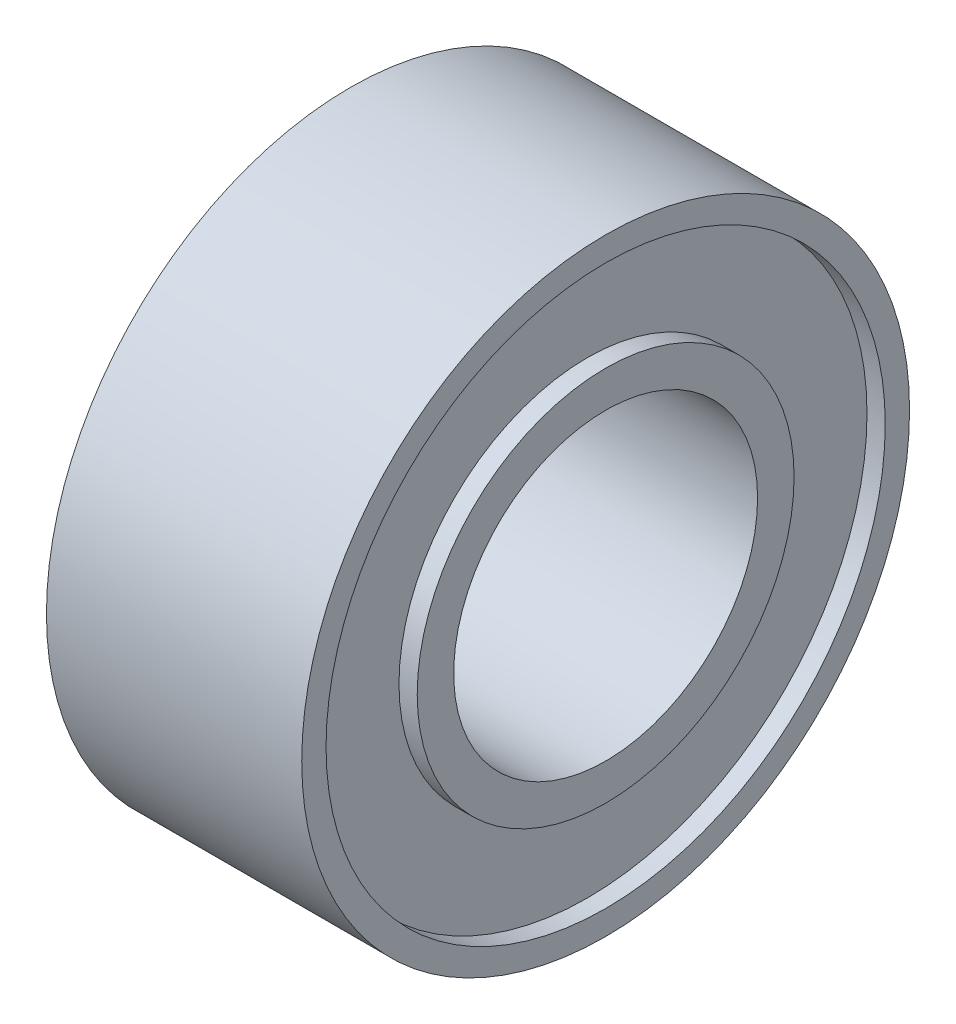
ISO-10303-21;
HEADER;
FILE_DESCRIPTION(('STEP AP214'),'2;1');
FILE_NAME('part.step','',(''),(''),'','','');
FILE_SCHEMA(('AUTOMOTIVE_DESIGN { 1 0 10303 214 1 1 1 1 }'));
ENDSEC;
DATA;
#1=APPLICATION_CONTEXT('core data for automotive mechanical design processes');
#2=APPLICATION_PROTOCOL_DEFINITION('international standard','automotive_design',2000,#1);
#3=PRODUCT_CONTEXT('',#1,'mechanical');
#4=PRODUCT('Part','Part','',(#3));
#5=PRODUCT_RELATED_PRODUCT_CATEGORY('part','',(#4));
#6=PRODUCT_DEFINITION_FORMATION('','',#4);
#7=PRODUCT_DEFINITION_CONTEXT('part definition',#1,'design');
#8=PRODUCT_DEFINITION('design','',#6,#7);
#9=PRODUCT_DEFINITION_SHAPE('','',#8);
#10=(LENGTH_UNIT() NAMED_UNIT(*) SI_UNIT(.MILLI.,.METRE.));
#11=(NAMED_UNIT(*) PLANE_ANGLE_UNIT() SI_UNIT($,.RADIAN.));
#12=(NAMED_UNIT(*) SI_UNIT($,.STERADIAN.) SOLID_ANGLE_UNIT());
#13=UNCERTAINTY_MEASURE_WITH_UNIT(LENGTH_MEASURE(1.E-05),#10,'distance_accuracy_value','');
#14=(GEOMETRIC_REPRESENTATION_CONTEXT(3) GLOBAL_UNCERTAINTY_ASSIGNED_CONTEXT((#13)) GLOBAL_UNIT_ASSIGNED_CONTEXT((#10,
#11,#12)) REPRESENTATION_CONTEXT('',''));
#15=CARTESIAN_POINT('',(0.,0.,0.));
#16=DIRECTION('',(0.,0.,1.));
#17=DIRECTION('',(1.,0.,0.));
#18=AXIS2_PLACEMENT_3D('',#15,#16,#17);
#19=CARTESIAN_POINT('',(-2.1,2.5,0.));
#20=DIRECTION('',(-1.,0.,0.));
#21=DIRECTION('',(0.,0.,1.));
#22=AXIS2_PLACEMENT_3D('',#19,#20,#21);
#23=PLANE('',#22);
#24=CARTESIAN_POINT('',(-2.1,0.,0.));
#25=DIRECTION('',(1.,0.,0.));
#26=DIRECTION('',(0.,0.,-1.));
#27=AXIS2_PLACEMENT_3D('',#24,#25,#26);
#28=CIRCLE('',#27,2.5);
#29=CARTESIAN_POINT('',(-2.1,0.,-2.5));
#30=VERTEX_POINT('',#29);
#31=EDGE_CURVE('E81',#30,#30,#28,.T.);
#32=ORIENTED_EDGE('',*,*,#31,.T.);
#33=EDGE_LOOP('',(#32));
#34=FACE_BOUND('',#33,.T.);
#35=CARTESIAN_POINT('',(-2.1,0.,0.));
#36=DIRECTION('',(1.,0.,0.));
#37=DIRECTION('',(0.,0.,-1.));
#38=AXIS2_PLACEMENT_3D('',#35,#36,#37);
#39=CIRCLE('',#38,3.1);
#40=CARTESIAN_POINT('',(-2.1,0.,-3.1));
#41=VERTEX_POINT('',#40);
#42=EDGE_CURVE('E10',#41,#41,#39,.T.);
#43=ORIENTED_EDGE('',*,*,#42,.F.);
#44=EDGE_LOOP('',(#43));
#45=FACE_BOUND('',#44,.T.);
#46=ADVANCED_FACE('F41',(#34,#45),#23,.T.);
#47=CARTESIAN_POINT('',(0.,0.,0.));
#48=DIRECTION('',(1.,0.,0.));
#49=DIRECTION('',(0.,0.,-1.));
#50=AXIS2_PLACEMENT_3D('',#47,#48,#49);
#51=CYLINDRICAL_SURFACE('',#50,3.1);
#52=ORIENTED_EDGE('',*,*,#42,.T.);
#53=EDGE_LOOP('',(#52));
#54=FACE_BOUND('',#53,.T.);
#55=CARTESIAN_POINT('',(-1.8,0.,0.));
#56=DIRECTION('',(1.,0.,0.));
#57=DIRECTION('',(0.,0.,-1.));
#58=AXIS2_PLACEMENT_3D('',#55,#56,#57);
#59=CIRCLE('',#58,3.1);
#60=CARTESIAN_POINT('',(-1.8,0.,-3.1));
#61=VERTEX_POINT('',#60);
#62=EDGE_CURVE('E47',#61,#61,#59,.T.);
#63=ORIENTED_EDGE('',*,*,#62,.F.);
#64=EDGE_LOOP('',(#63));
#65=FACE_BOUND('',#64,.T.);
#66=ADVANCED_FACE('F99',(#54,#65),#51,.T.);
#67=CARTESIAN_POINT('',(-1.8,3.1,0.));
#68=DIRECTION('',(-1.,0.,0.));
#69=DIRECTION('',(0.,0.,1.));
#70=AXIS2_PLACEMENT_3D('',#67,#68,#69);
#71=PLANE('',#70);
#72=ORIENTED_EDGE('',*,*,#62,.T.);
#73=EDGE_LOOP('',(#72));
#74=FACE_BOUND('',#73,.T.);
#75=CARTESIAN_POINT('',(-1.8,0.,0.));
#76=DIRECTION('',(1.,0.,0.));
#77=DIRECTION('',(0.,0.,-1.));
#78=AXIS2_PLACEMENT_3D('',#75,#76,#77);
#79=CIRCLE('',#78,4.6);
#80=CARTESIAN_POINT('',(-1.8,0.,-4.6));
#81=VERTEX_POINT('',#80);
#82=EDGE_CURVE('E51',#81,#81,#79,.T.);
#83=ORIENTED_EDGE('',*,*,#82,.F.);
#84=EDGE_LOOP('',(#83));
#85=FACE_BOUND('',#84,.T.);
#86=ADVANCED_FACE('F103',(#74,#85),#71,.T.);
#87=CARTESIAN_POINT('',(0.,0.,0.));
#88=DIRECTION('',(1.,0.,0.));
#89=DIRECTION('',(0.,0.,-1.));
#90=AXIS2_PLACEMENT_3D('',#87,#88,#89);
#91=CYLINDRICAL_SURFACE('',#90,4.6);
#92=ORIENTED_EDGE('',*,*,#82,.T.);
#93=EDGE_LOOP('',(#92));
#94=FACE_BOUND('',#93,.T.);
#95=CARTESIAN_POINT('',(-2.1,0.,0.));
#96=DIRECTION('',(1.,0.,0.));
#97=DIRECTION('',(0.,0.,-1.));
#98=AXIS2_PLACEMENT_3D('',#95,#96,#97);
#99=CIRCLE('',#98,4.6);
#100=CARTESIAN_POINT('',(-2.1,0.,-4.6));
#101=VERTEX_POINT('',#100);
#102=EDGE_CURVE('E55',#101,#101,#99,.T.);
#103=ORIENTED_EDGE('',*,*,#102,.F.);
#104=EDGE_LOOP('',(#103));
#105=FACE_BOUND('',#104,.T.);
#106=ADVANCED_FACE('F108',(#94,#105),#91,.F.);
#107=CARTESIAN_POINT('',(-2.1,4.6,0.));
#108=DIRECTION('',(-1.,0.,0.));
#109=DIRECTION('',(0.,0.,1.));
#110=AXIS2_PLACEMENT_3D('',#107,#108,#109);
#111=PLANE('',#110);
#112=ORIENTED_EDGE('',*,*,#102,.T.);
#113=EDGE_LOOP('',(#112));
#114=FACE_BOUND('',#113,.T.);
#115=CARTESIAN_POINT('',(-2.1,0.,0.));
#116=DIRECTION('',(1.,0.,0.));
#117=DIRECTION('',(0.,0.,-1.));
#118=AXIS2_PLACEMENT_3D('',#115,#116,#117);
#119=CIRCLE('',#118,5.);
#120=CARTESIAN_POINT('',(-2.1,0.,-5.));
#121=VERTEX_POINT('',#120);
#122=EDGE_CURVE('E60',#121,#121,#119,.T.);
#123=ORIENTED_EDGE('',*,*,#122,.F.);
#124=EDGE_LOOP('',(#123));
#125=FACE_BOUND('',#124,.T.);
#126=ADVANCED_FACE('F114',(#114,#125),#111,.T.);
#127=CARTESIAN_POINT('',(0.,0.,0.));
#128=DIRECTION('',(1.,0.,0.));
#129=DIRECTION('',(0.,0.,-1.));
#130=AXIS2_PLACEMENT_3D('',#127,#128,#129);
#131=CYLINDRICAL_SURFACE('',#130,5.);
#132=ORIENTED_EDGE('',*,*,#122,.T.);
#133=EDGE_LOOP('',(#132));
#134=FACE_BOUND('',#133,.T.);
#135=CARTESIAN_POINT('',(2.1,0.,0.));
#136=DIRECTION('',(1.,0.,0.));
#137=DIRECTION('',(0.,0.,-1.));
#138=AXIS2_PLACEMENT_3D('',#135,#136,#137);
#139=CIRCLE('',#138,5.);
#140=CARTESIAN_POINT('',(2.1,0.,-5.));
#141=VERTEX_POINT('',#140);
#142=EDGE_CURVE('E63',#141,#141,#139,.T.);
#143=ORIENTED_EDGE('',*,*,#142,.F.);
#144=EDGE_LOOP('',(#143));
#145=FACE_BOUND('',#144,.T.);
#146=ADVANCED_FACE('F118',(#134,#145),#131,.T.);
#147=CARTESIAN_POINT('',(2.1,4.6,0.));
#148=DIRECTION('',(1.,0.,0.));
#149=DIRECTION('',(0.,0.,-1.));
#150=AXIS2_PLACEMENT_3D('',#147,#148,#149);
#151=PLANE('',#150);
#152=ORIENTED_EDGE('',*,*,#142,.T.);
#153=EDGE_LOOP('',(#152));
#154=FACE_BOUND('',#153,.T.);
#155=CARTESIAN_POINT('',(2.1,0.,0.));
#156=DIRECTION('',(1.,0.,0.));
#157=DIRECTION('',(0.,0.,-1.));
#158=AXIS2_PLACEMENT_3D('',#155,#156,#157);
#159=CIRCLE('',#158,4.6);
#160=CARTESIAN_POINT('',(2.1,0.,-4.6));
#161=VERTEX_POINT('',#160);
#162=EDGE_CURVE('E66',#161,#161,#159,.T.);
#163=ORIENTED_EDGE('',*,*,#162,.F.);
#164=EDGE_LOOP('',(#163));
#165=FACE_BOUND('',#164,.T.);
#166=ADVANCED_FACE('F122',(#154,#165),#151,.T.);
#167=CARTESIAN_POINT('',(0.,0.,0.));
#168=DIRECTION('',(1.,0.,0.));
#169=DIRECTION('',(0.,0.,-1.));
#170=AXIS2_PLACEMENT_3D('',#167,#168,#169);
#171=CYLINDRICAL_SURFACE('',#170,4.6);
#172=ORIENTED_EDGE('',*,*,#162,.T.);
#173=EDGE_LOOP('',(#172));
#174=FACE_BOUND('',#173,.T.);
#175=CARTESIAN_POINT('',(1.8,0.,0.));
#176=DIRECTION('',(1.,0.,0.));
#177=DIRECTION('',(0.,0.,-1.));
#178=AXIS2_PLACEMENT_3D('',#175,#176,#177);
#179=CIRCLE('',#178,4.6);
#180=CARTESIAN_POINT('',(1.8,0.,-4.6));
#181=VERTEX_POINT('',#180);
#182=EDGE_CURVE('E69',#181,#181,#179,.T.);
#183=ORIENTED_EDGE('',*,*,#182,.F.);
#184=EDGE_LOOP('',(#183));
#185=FACE_BOUND('',#184,.T.);
#186=ADVANCED_FACE('F126',(#174,#185),#171,.F.);
#187=CARTESIAN_POINT('',(1.8,3.1,0.));
#188=DIRECTION('',(1.,0.,0.));
#189=DIRECTION('',(0.,0.,-1.));
#190=AXIS2_PLACEMENT_3D('',#187,#188,#189);
#191=PLANE('',#190);
#192=ORIENTED_EDGE('',*,*,#182,.T.);
#193=EDGE_LOOP('',(#192));
#194=FACE_BOUND('',#193,.T.);
#195=CARTESIAN_POINT('',(1.8,0.,0.));
#196=DIRECTION('',(1.,0.,0.));
#197=DIRECTION('',(0.,0.,-1.));
#198=AXIS2_PLACEMENT_3D('',#195,#196,#197);
#199=CIRCLE('',#198,3.1);
#200=CARTESIAN_POINT('',(1.8,0.,-3.1));
#201=VERTEX_POINT('',#200);
#202=EDGE_CURVE('E72',#201,#201,#199,.T.);
#203=ORIENTED_EDGE('',*,*,#202,.F.);
#204=EDGE_LOOP('',(#203));
#205=FACE_BOUND('',#204,.T.);
#206=ADVANCED_FACE('F130',(#194,#205),#191,.T.);
#207=CARTESIAN_POINT('',(0.,0.,0.));
#208=DIRECTION('',(1.,0.,0.));
#209=DIRECTION('',(0.,0.,-1.));
#210=AXIS2_PLACEMENT_3D('',#207,#208,#209);
#211=CYLINDRICAL_SURFACE('',#210,3.1);
#212=ORIENTED_EDGE('',*,*,#202,.T.);
#213=EDGE_LOOP('',(#212));
#214=FACE_BOUND('',#213,.T.);
#215=CARTESIAN_POINT('',(2.1,0.,0.));
#216=DIRECTION('',(1.,0.,0.));
#217=DIRECTION('',(0.,0.,-1.));
#218=AXIS2_PLACEMENT_3D('',#215,#216,#217);
#219=CIRCLE('',#218,3.1);
#220=CARTESIAN_POINT('',(2.1,0.,-3.1));
#221=VERTEX_POINT('',#220);
#222=EDGE_CURVE('E75',#221,#221,#219,.T.);
#223=ORIENTED_EDGE('',*,*,#222,.F.);
#224=EDGE_LOOP('',(#223));
#225=FACE_BOUND('',#224,.T.);
#226=ADVANCED_FACE('F95',(#214,#225),#211,.T.);
#227=CARTESIAN_POINT('',(2.1,2.5,0.));
#228=DIRECTION('',(1.,0.,0.));
#229=DIRECTION('',(0.,0.,-1.));
#230=AXIS2_PLACEMENT_3D('',#227,#228,#229);
#231=PLANE('',#230);
#232=ORIENTED_EDGE('',*,*,#222,.T.);
#233=EDGE_LOOP('',(#232));
#234=FACE_BOUND('',#233,.T.);
#235=CARTESIAN_POINT('',(2.1,0.,0.));
#236=DIRECTION('',(1.,0.,0.));
#237=DIRECTION('',(0.,0.,-1.));
#238=AXIS2_PLACEMENT_3D('',#235,#236,#237);
#239=CIRCLE('',#238,2.5);
#240=CARTESIAN_POINT('',(2.1,0.,-2.5));
#241=VERTEX_POINT('',#240);
#242=EDGE_CURVE('E78',#241,#241,#239,.T.);
#243=ORIENTED_EDGE('',*,*,#242,.F.);
#244=EDGE_LOOP('',(#243));
#245=FACE_BOUND('',#244,.T.);
#246=ADVANCED_FACE('F89',(#234,#245),#231,.T.);
#247=CARTESIAN_POINT('',(0.,0.,0.));
#248=DIRECTION('',(1.,0.,0.));
#249=DIRECTION('',(0.,0.,-1.));
#250=AXIS2_PLACEMENT_3D('',#247,#248,#249);
#251=CYLINDRICAL_SURFACE('',#250,2.5);
#252=ORIENTED_EDGE('',*,*,#242,.T.);
#253=EDGE_LOOP('',(#252));
#254=FACE_BOUND('',#253,.T.);
#255=ORIENTED_EDGE('',*,*,#31,.F.);
#256=EDGE_LOOP('',(#255));
#257=FACE_BOUND('',#256,.T.);
#258=ADVANCED_FACE('F87',(#254,#257),#251,.F.);
#259=CLOSED_SHELL('',(#46,#66,#86,#106,#126,#146,#166,#186,#206,#226,#246,#258));
#260=MANIFOLD_SOLID_BREP('B2',#259);
#261=ADVANCED_BREP_SHAPE_REPRESENTATION('',(#18,#260),#14);
#262=SHAPE_DEFINITION_REPRESENTATION(#9,#261);
ENDSEC;
END-ISO-10303-21;
